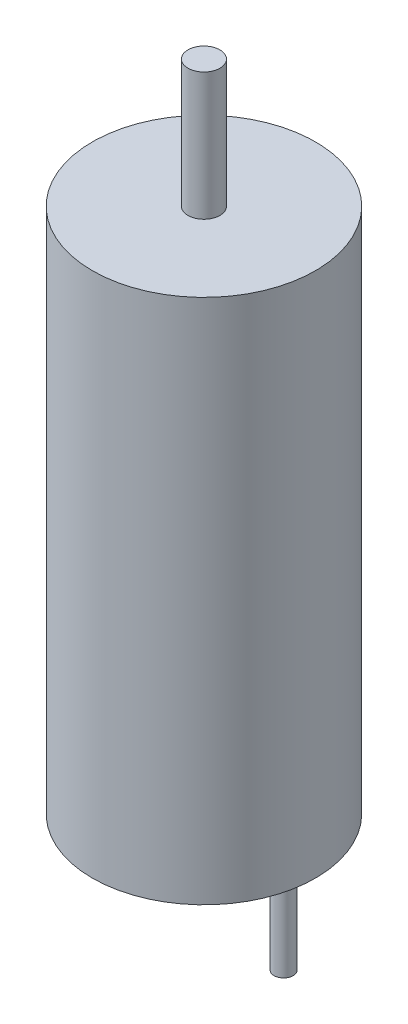
ISO-10303-21;
HEADER;
FILE_DESCRIPTION(('STEP AP214'),'2;1');
FILE_NAME('part.step','',(''),(''),'','','');
FILE_SCHEMA(('AUTOMOTIVE_DESIGN { 1 0 10303 214 1 1 1 1 }'));
ENDSEC;
DATA;
#1=APPLICATION_CONTEXT('core data for automotive mechanical design processes');
#2=APPLICATION_PROTOCOL_DEFINITION('international standard','automotive_design',2000,#1);
#3=PRODUCT_CONTEXT('',#1,'mechanical');
#4=PRODUCT('Part','Part','',(#3));
#5=PRODUCT_RELATED_PRODUCT_CATEGORY('part','',(#4));
#6=PRODUCT_DEFINITION_FORMATION('','',#4);
#7=PRODUCT_DEFINITION_CONTEXT('part definition',#1,'design');
#8=PRODUCT_DEFINITION('design','',#6,#7);
#9=PRODUCT_DEFINITION_SHAPE('','',#8);
#10=(LENGTH_UNIT() NAMED_UNIT(*) SI_UNIT(.MILLI.,.METRE.));
#11=(NAMED_UNIT(*) PLANE_ANGLE_UNIT() SI_UNIT($,.RADIAN.));
#12=(NAMED_UNIT(*) SI_UNIT($,.STERADIAN.) SOLID_ANGLE_UNIT());
#13=UNCERTAINTY_MEASURE_WITH_UNIT(LENGTH_MEASURE(1.E-05),#10,'distance_accuracy_value','');
#14=(GEOMETRIC_REPRESENTATION_CONTEXT(3) GLOBAL_UNCERTAINTY_ASSIGNED_CONTEXT((#13)) GLOBAL_UNIT_ASSIGNED_CONTEXT((#10,
#11,#12)) REPRESENTATION_CONTEXT('',''));
#15=CARTESIAN_POINT('',(0.,0.,0.));
#16=DIRECTION('',(0.,0.,1.));
#17=DIRECTION('',(1.,0.,0.));
#18=AXIS2_PLACEMENT_3D('',#15,#16,#17);
#19=CARTESIAN_POINT('',(0.,-16.5,0.));
#20=DIRECTION('',(0.,1.,0.));
#21=DIRECTION('',(0.,0.,1.));
#22=AXIS2_PLACEMENT_3D('',#19,#20,#21);
#23=CYLINDRICAL_SURFACE('',#22,3.5);
#24=CARTESIAN_POINT('',(0.,-16.5,0.));
#25=DIRECTION('',(0.,1.,0.));
#26=DIRECTION('',(0.,0.,1.));
#27=AXIS2_PLACEMENT_3D('',#24,#25,#26);
#28=CIRCLE('',#27,3.5);
#29=CARTESIAN_POINT('',(0.,-16.5,3.5));
#30=VERTEX_POINT('',#29);
#31=EDGE_CURVE('E42',#30,#30,#28,.T.);
#32=ORIENTED_EDGE('',*,*,#31,.T.);
#33=EDGE_LOOP('',(#32));
#34=FACE_BOUND('',#33,.T.);
#35=CARTESIAN_POINT('',(0.,0.,0.));
#36=DIRECTION('',(0.,1.,0.));
#37=DIRECTION('',(0.,0.,1.));
#38=AXIS2_PLACEMENT_3D('',#35,#36,#37);
#39=CIRCLE('',#38,3.5);
#40=CARTESIAN_POINT('',(0.,0.,3.5));
#41=VERTEX_POINT('',#40);
#42=EDGE_CURVE('E46',#41,#41,#39,.T.);
#43=ORIENTED_EDGE('',*,*,#42,.F.);
#44=EDGE_LOOP('',(#43));
#45=FACE_BOUND('',#44,.T.);
#46=ADVANCED_FACE('F32',(#34,#45),#23,.T.);
#47=CARTESIAN_POINT('',(0.,-16.5,0.));
#48=DIRECTION('',(0.,1.,0.));
#49=DIRECTION('',(0.,0.,1.));
#50=AXIS2_PLACEMENT_3D('',#47,#48,#49);
#51=PLANE('',#50);
#52=CARTESIAN_POINT('',(2.5,-16.5,0.));
#53=DIRECTION('',(0.,1.,0.));
#54=DIRECTION('',(0.,0.,1.));
#55=AXIS2_PLACEMENT_3D('',#52,#53,#54);
#56=CIRCLE('',#55,0.3);
#57=CARTESIAN_POINT('',(2.5,-16.5,0.3));
#58=VERTEX_POINT('',#57);
#59=EDGE_CURVE('E10',#58,#58,#56,.F.);
#60=ORIENTED_EDGE('',*,*,#59,.F.);
#61=EDGE_LOOP('',(#60));
#62=FACE_BOUND('',#61,.T.);
#63=CARTESIAN_POINT('',(-2.5,-16.5,0.));
#64=DIRECTION('',(0.,1.,0.));
#65=DIRECTION('',(0.,0.,1.));
#66=AXIS2_PLACEMENT_3D('',#63,#64,#65);
#67=CIRCLE('',#66,0.3);
#68=CARTESIAN_POINT('',(-2.5,-16.5,0.3));
#69=VERTEX_POINT('',#68);
#70=EDGE_CURVE('E38',#69,#69,#67,.F.);
#71=ORIENTED_EDGE('',*,*,#70,.F.);
#72=EDGE_LOOP('',(#71));
#73=FACE_BOUND('',#72,.T.);
#74=ORIENTED_EDGE('',*,*,#31,.F.);
#75=EDGE_LOOP('',(#74));
#76=FACE_BOUND('',#75,.T.);
#77=ADVANCED_FACE('F79',(#62,#73,#76),#51,.F.);
#78=CARTESIAN_POINT('',(0.,0.,0.));
#79=DIRECTION('',(0.,1.,0.));
#80=DIRECTION('',(0.,0.,1.));
#81=AXIS2_PLACEMENT_3D('',#78,#79,#80);
#82=PLANE('',#81);
#83=CARTESIAN_POINT('',(0.,0.,0.));
#84=DIRECTION('',(0.,1.,0.));
#85=DIRECTION('',(0.,0.,1.));
#86=AXIS2_PLACEMENT_3D('',#83,#84,#85);
#87=CIRCLE('',#86,0.5);
#88=CARTESIAN_POINT('',(0.,0.,0.5));
#89=VERTEX_POINT('',#88);
#90=EDGE_CURVE('E52',#89,#89,#87,.T.);
#91=ORIENTED_EDGE('',*,*,#90,.F.);
#92=EDGE_LOOP('',(#91));
#93=FACE_BOUND('',#92,.T.);
#94=ORIENTED_EDGE('',*,*,#42,.T.);
#95=EDGE_LOOP('',(#94));
#96=FACE_BOUND('',#95,.T.);
#97=ADVANCED_FACE('F84',(#93,#96),#82,.T.);
#98=CARTESIAN_POINT('',(0.,4.,0.));
#99=DIRECTION('',(0.,-1.,0.));
#100=DIRECTION('',(0.,0.,-1.));
#101=AXIS2_PLACEMENT_3D('',#98,#99,#100);
#102=CYLINDRICAL_SURFACE('',#101,0.5);
#103=CARTESIAN_POINT('',(0.,4.,0.));
#104=DIRECTION('',(0.,1.,0.));
#105=DIRECTION('',(0.,0.,1.));
#106=AXIS2_PLACEMENT_3D('',#103,#104,#105);
#107=CIRCLE('',#106,0.5);
#108=CARTESIAN_POINT('',(0.,4.,0.5));
#109=VERTEX_POINT('',#108);
#110=EDGE_CURVE('E50',#109,#109,#107,.T.);
#111=ORIENTED_EDGE('',*,*,#110,.F.);
#112=EDGE_LOOP('',(#111));
#113=FACE_BOUND('',#112,.T.);
#114=ORIENTED_EDGE('',*,*,#90,.T.);
#115=EDGE_LOOP('',(#114));
#116=FACE_BOUND('',#115,.T.);
#117=ADVANCED_FACE('F92',(#113,#116),#102,.T.);
#118=CARTESIAN_POINT('',(0.,4.,0.));
#119=DIRECTION('',(0.,1.,0.));
#120=DIRECTION('',(0.,0.,1.));
#121=AXIS2_PLACEMENT_3D('',#118,#119,#120);
#122=PLANE('',#121);
#123=ORIENTED_EDGE('',*,*,#110,.T.);
#124=EDGE_LOOP('',(#123));
#125=FACE_BOUND('',#124,.T.);
#126=ADVANCED_FACE('F97',(#125),#122,.T.);
#127=CARTESIAN_POINT('',(-2.5,-19.5,0.));
#128=DIRECTION('',(0.,1.,0.));
#129=DIRECTION('',(0.,0.,1.));
#130=AXIS2_PLACEMENT_3D('',#127,#128,#129);
#131=CYLINDRICAL_SURFACE('',#130,0.3);
#132=CARTESIAN_POINT('',(-2.5,-19.5,0.));
#133=DIRECTION('',(0.,-1.,0.));
#134=DIRECTION('',(0.,0.,1.));
#135=AXIS2_PLACEMENT_3D('',#132,#133,#134);
#136=CIRCLE('',#135,0.3);
#137=CARTESIAN_POINT('',(-2.5,-19.5,0.3));
#138=VERTEX_POINT('',#137);
#139=EDGE_CURVE('E55',#138,#138,#136,.T.);
#140=ORIENTED_EDGE('',*,*,#139,.F.);
#141=EDGE_LOOP('',(#140));
#142=FACE_BOUND('',#141,.T.);
#143=ORIENTED_EDGE('',*,*,#70,.T.);
#144=EDGE_LOOP('',(#143));
#145=FACE_BOUND('',#144,.T.);
#146=ADVANCED_FACE('F75',(#142,#145),#131,.T.);
#147=CARTESIAN_POINT('',(-2.5,-19.5,0.));
#148=DIRECTION('',(0.,1.,0.));
#149=DIRECTION('',(0.,0.,1.));
#150=AXIS2_PLACEMENT_3D('',#147,#148,#149);
#151=PLANE('',#150);
#152=ORIENTED_EDGE('',*,*,#139,.T.);
#153=EDGE_LOOP('',(#152));
#154=FACE_BOUND('',#153,.T.);
#155=ADVANCED_FACE('F68',(#154),#151,.F.);
#156=CARTESIAN_POINT('',(2.5,-19.5,0.));
#157=DIRECTION('',(0.,1.,0.));
#158=DIRECTION('',(0.,0.,1.));
#159=AXIS2_PLACEMENT_3D('',#156,#157,#158);
#160=CYLINDRICAL_SURFACE('',#159,0.3);
#161=CARTESIAN_POINT('',(2.5,-19.5,0.));
#162=DIRECTION('',(0.,-1.,0.));
#163=DIRECTION('',(0.,0.,-1.));
#164=AXIS2_PLACEMENT_3D('',#161,#162,#163);
#165=CIRCLE('',#164,0.3);
#166=CARTESIAN_POINT('',(2.5,-19.5,-0.3));
#167=VERTEX_POINT('',#166);
#168=EDGE_CURVE('E60',#167,#167,#165,.T.);
#169=ORIENTED_EDGE('',*,*,#168,.F.);
#170=EDGE_LOOP('',(#169));
#171=FACE_BOUND('',#170,.T.);
#172=ORIENTED_EDGE('',*,*,#59,.T.);
#173=EDGE_LOOP('',(#172));
#174=FACE_BOUND('',#173,.T.);
#175=ADVANCED_FACE('F66',(#171,#174),#160,.T.);
#176=CARTESIAN_POINT('',(2.5,-19.5,0.));
#177=DIRECTION('',(0.,-1.,0.));
#178=DIRECTION('',(0.,0.,-1.));
#179=AXIS2_PLACEMENT_3D('',#176,#177,#178);
#180=PLANE('',#179);
#181=ORIENTED_EDGE('',*,*,#168,.T.);
#182=EDGE_LOOP('',(#181));
#183=FACE_BOUND('',#182,.T.);
#184=ADVANCED_FACE('F64',(#183),#180,.T.);
#185=CLOSED_SHELL('',(#46,#77,#97,#117,#126,#146,#155,#175,#184));
#186=MANIFOLD_SOLID_BREP('B2',#185);
#187=ADVANCED_BREP_SHAPE_REPRESENTATION('',(#18,#186),#14);
#188=SHAPE_DEFINITION_REPRESENTATION(#9,#187);
ENDSEC;
END-ISO-10303-21;
